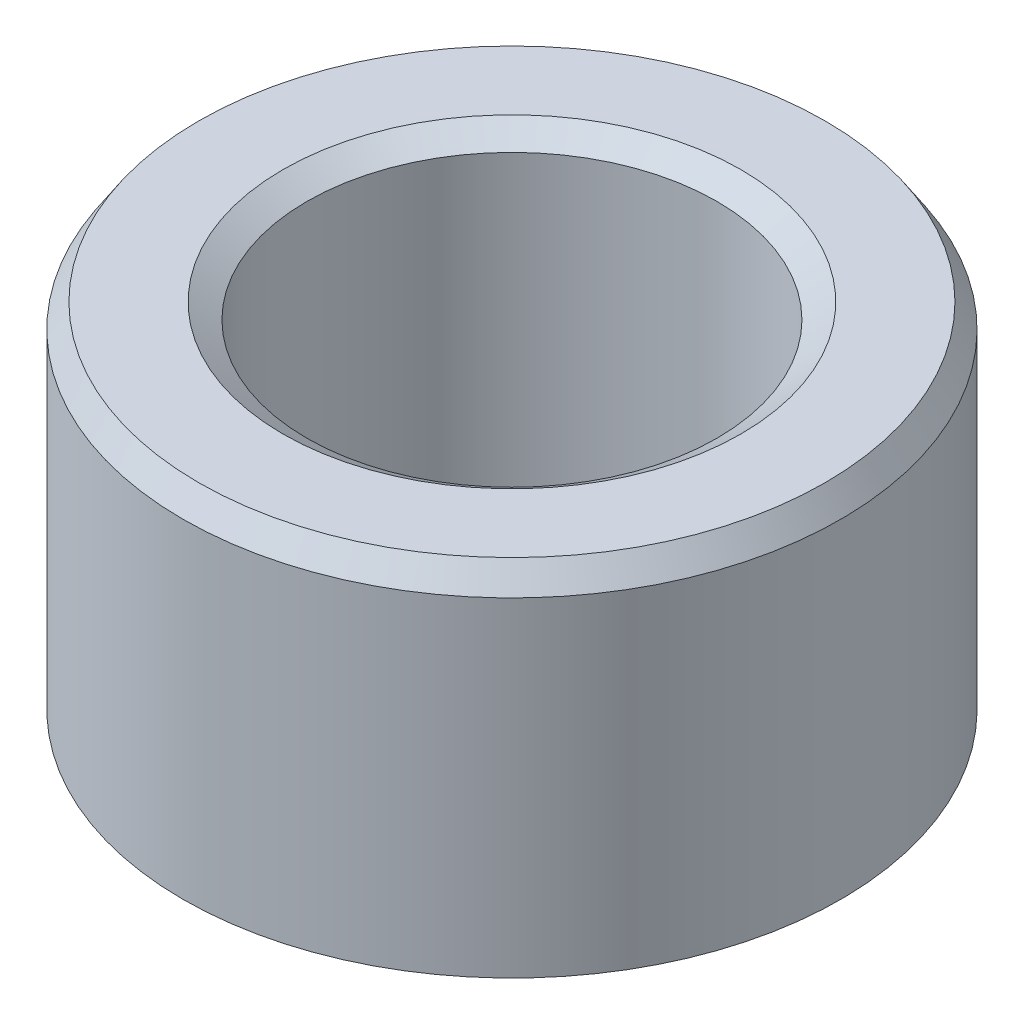
ISO-10303-21;
HEADER;
FILE_DESCRIPTION(('STEP AP214'),'2;1');
FILE_NAME('part.step','',(''),(''),'','','');
FILE_SCHEMA(('AUTOMOTIVE_DESIGN { 1 0 10303 214 1 1 1 1 }'));
ENDSEC;
DATA;
#1=APPLICATION_CONTEXT('core data for automotive mechanical design processes');
#2=APPLICATION_PROTOCOL_DEFINITION('international standard','automotive_design',2000,#1);
#3=PRODUCT_CONTEXT('',#1,'mechanical');
#4=PRODUCT('Part','Part','',(#3));
#5=PRODUCT_RELATED_PRODUCT_CATEGORY('part','',(#4));
#6=PRODUCT_DEFINITION_FORMATION('','',#4);
#7=PRODUCT_DEFINITION_CONTEXT('part definition',#1,'design');
#8=PRODUCT_DEFINITION('design','',#6,#7);
#9=PRODUCT_DEFINITION_SHAPE('','',#8);
#10=(LENGTH_UNIT() NAMED_UNIT(*) SI_UNIT(.MILLI.,.METRE.));
#11=(NAMED_UNIT(*) PLANE_ANGLE_UNIT() SI_UNIT($,.RADIAN.));
#12=(NAMED_UNIT(*) SI_UNIT($,.STERADIAN.) SOLID_ANGLE_UNIT());
#13=UNCERTAINTY_MEASURE_WITH_UNIT(LENGTH_MEASURE(1.E-05),#10,'distance_accuracy_value','');
#14=(GEOMETRIC_REPRESENTATION_CONTEXT(3) GLOBAL_UNCERTAINTY_ASSIGNED_CONTEXT((#13)) GLOBAL_UNIT_ASSIGNED_CONTEXT((#10,
#11,#12)) REPRESENTATION_CONTEXT('',''));
#15=CARTESIAN_POINT('',(0.,0.,0.));
#16=DIRECTION('',(0.,0.,1.));
#17=DIRECTION('',(1.,0.,0.));
#18=AXIS2_PLACEMENT_3D('',#15,#16,#17);
#19=CARTESIAN_POINT('',(0.,53.2531251113508,0.));
#20=DIRECTION('',(0.,-1.,0.));
#21=DIRECTION('',(0.,0.,-1.));
#22=AXIS2_PLACEMENT_3D('',#19,#20,#21);
#23=CYLINDRICAL_SURFACE('',#22,47.5);
#24=CARTESIAN_POINT('',(0.,2.25509263896022,0.));
#25=DIRECTION('',(0.,1.,0.));
#26=DIRECTION('',(0.,0.,1.));
#27=AXIS2_PLACEMENT_3D('',#24,#25,#26);
#28=CIRCLE('',#27,47.5);
#29=CARTESIAN_POINT('',(0.,2.25509263896022,47.5));
#30=VERTEX_POINT('',#29);
#31=EDGE_CURVE('E10',#30,#30,#28,.T.);
#32=ORIENTED_EDGE('',*,*,#31,.T.);
#33=EDGE_LOOP('',(#32));
#34=FACE_BOUND('',#33,.T.);
#35=CARTESIAN_POINT('',(0.,49.7995104509907,0.));
#36=DIRECTION('',(0.,1.,0.));
#37=DIRECTION('',(0.,0.,1.));
#38=AXIS2_PLACEMENT_3D('',#35,#36,#37);
#39=CIRCLE('',#38,47.5);
#40=CARTESIAN_POINT('',(0.,49.7995104509907,47.5));
#41=VERTEX_POINT('',#40);
#42=EDGE_CURVE('E50',#41,#41,#39,.F.);
#43=ORIENTED_EDGE('',*,*,#42,.T.);
#44=EDGE_LOOP('',(#43));
#45=FACE_BOUND('',#44,.T.);
#46=ADVANCED_FACE('F39',(#34,#45),#23,.T.);
#47=CARTESIAN_POINT('',(0.,53.2531251113508,0.));
#48=DIRECTION('',(0.,1.,0.));
#49=DIRECTION('',(0.,0.,1.));
#50=AXIS2_PLACEMENT_3D('',#47,#48,#49);
#51=PLANE('',#50);
#52=CARTESIAN_POINT('',(0.,53.2531251113508,0.));
#53=DIRECTION('',(0.,1.,0.));
#54=DIRECTION('',(0.,0.,1.));
#55=AXIS2_PLACEMENT_3D('',#52,#53,#54);
#56=CIRCLE('',#55,33.072922726898);
#57=CARTESIAN_POINT('',(0.,53.2531251113508,33.072922726898));
#58=VERTEX_POINT('',#57);
#59=EDGE_CURVE('E58',#58,#58,#56,.F.);
#60=ORIENTED_EDGE('',*,*,#59,.T.);
#61=EDGE_LOOP('',(#60));
#62=FACE_BOUND('',#61,.T.);
#63=CARTESIAN_POINT('',(0.,53.2531251113508,0.));
#64=DIRECTION('',(0.,1.,0.));
#65=DIRECTION('',(0.,0.,1.));
#66=AXIS2_PLACEMENT_3D('',#63,#64,#65);
#67=CIRCLE('',#66,45.2449073610398);
#68=CARTESIAN_POINT('',(0.,53.2531251113508,45.2449073610398));
#69=VERTEX_POINT('',#68);
#70=EDGE_CURVE('E61',#69,#69,#67,.T.);
#71=ORIENTED_EDGE('',*,*,#70,.T.);
#72=EDGE_LOOP('',(#71));
#73=FACE_BOUND('',#72,.T.);
#74=ADVANCED_FACE('F88',(#62,#73),#51,.T.);
#75=CARTESIAN_POINT('',(0.,0.,0.));
#76=DIRECTION('',(0.,1.,0.));
#77=DIRECTION('',(0.,0.,1.));
#78=AXIS2_PLACEMENT_3D('',#75,#76,#77);
#79=PLANE('',#78);
#80=CARTESIAN_POINT('',(0.,0.,0.));
#81=DIRECTION('',(0.,1.,0.));
#82=DIRECTION('',(0.,0.,1.));
#83=AXIS2_PLACEMENT_3D('',#80,#81,#82);
#84=CIRCLE('',#83,31.874400705498);
#85=CARTESIAN_POINT('',(0.,0.,31.874400705498));
#86=VERTEX_POINT('',#85);
#87=EDGE_CURVE('E51',#86,#86,#84,.T.);
#88=ORIENTED_EDGE('',*,*,#87,.T.);
#89=EDGE_LOOP('',(#88));
#90=FACE_BOUND('',#89,.T.);
#91=CARTESIAN_POINT('',(0.,0.,0.));
#92=DIRECTION('',(0.,1.,0.));
#93=DIRECTION('',(0.,0.,1.));
#94=AXIS2_PLACEMENT_3D('',#91,#92,#93);
#95=CIRCLE('',#94,44.0463853396399);
#96=CARTESIAN_POINT('',(0.,0.,44.0463853396399));
#97=VERTEX_POINT('',#96);
#98=EDGE_CURVE('E54',#97,#97,#95,.F.);
#99=ORIENTED_EDGE('',*,*,#98,.T.);
#100=EDGE_LOOP('',(#99));
#101=FACE_BOUND('',#100,.T.);
#102=ADVANCED_FACE('F83',(#90,#101),#79,.F.);
#103=CARTESIAN_POINT('',(0.,53.2531251113508,0.));
#104=DIRECTION('',(0.,-1.,0.));
#105=DIRECTION('',(0.,0.,-1.));
#106=AXIS2_PLACEMENT_3D('',#103,#104,#105);
#107=CYLINDRICAL_SURFACE('',#106,29.6193080665379);
#108=CARTESIAN_POINT('',(0.,50.9980324723906,0.));
#109=DIRECTION('',(0.,1.,0.));
#110=DIRECTION('',(0.,0.,1.));
#111=AXIS2_PLACEMENT_3D('',#108,#109,#110);
#112=CIRCLE('',#111,29.6193080665379);
#113=CARTESIAN_POINT('',(0.,50.9980324723906,29.6193080665379));
#114=VERTEX_POINT('',#113);
#115=EDGE_CURVE('E67',#114,#114,#112,.T.);
#116=ORIENTED_EDGE('',*,*,#115,.T.);
#117=EDGE_LOOP('',(#116));
#118=FACE_BOUND('',#117,.T.);
#119=CARTESIAN_POINT('',(0.,3.45361466036011,0.));
#120=DIRECTION('',(0.,1.,0.));
#121=DIRECTION('',(0.,0.,1.));
#122=AXIS2_PLACEMENT_3D('',#119,#120,#121);
#123=CIRCLE('',#122,29.6193080665379);
#124=CARTESIAN_POINT('',(0.,3.45361466036011,29.6193080665379));
#125=VERTEX_POINT('',#124);
#126=EDGE_CURVE('E69',#125,#125,#123,.F.);
#127=ORIENTED_EDGE('',*,*,#126,.T.);
#128=EDGE_LOOP('',(#127));
#129=FACE_BOUND('',#128,.T.);
#130=ADVANCED_FACE('F71',(#118,#129),#107,.F.);
#131=CARTESIAN_POINT('',(0.,50.9980324723906,0.));
#132=DIRECTION('',(0.,1.,0.));
#133=DIRECTION('',(0.,0.,1.));
#134=AXIS2_PLACEMENT_3D('',#131,#132,#133);
#135=CONICAL_SURFACE('',#134,29.6193080665379,0.992338932945223);
#136=ORIENTED_EDGE('',*,*,#59,.F.);
#137=EDGE_LOOP('',(#136));
#138=FACE_BOUND('',#137,.T.);
#139=ORIENTED_EDGE('',*,*,#115,.F.);
#140=EDGE_LOOP('',(#139));
#141=FACE_BOUND('',#140,.T.);
#142=ADVANCED_FACE('F77',(#138,#141),#135,.F.);
#143=CARTESIAN_POINT('',(0.,0.,0.));
#144=DIRECTION('',(0.,-1.,0.));
#145=DIRECTION('',(0.,0.,-1.));
#146=AXIS2_PLACEMENT_3D('',#143,#144,#145);
#147=CONICAL_SURFACE('',#146,31.874400705498,0.578457393849675);
#148=ORIENTED_EDGE('',*,*,#126,.F.);
#149=EDGE_LOOP('',(#148));
#150=FACE_BOUND('',#149,.T.);
#151=ORIENTED_EDGE('',*,*,#87,.F.);
#152=EDGE_LOOP('',(#151));
#153=FACE_BOUND('',#152,.T.);
#154=ADVANCED_FACE('F73',(#150,#153),#147,.F.);
#155=CARTESIAN_POINT('',(0.,2.25509263896022,0.));
#156=DIRECTION('',(0.,1.,0.));
#157=DIRECTION('',(0.,0.,1.));
#158=AXIS2_PLACEMENT_3D('',#155,#156,#157);
#159=CONICAL_SURFACE('',#158,47.5,0.992338932945223);
#160=ORIENTED_EDGE('',*,*,#98,.F.);
#161=EDGE_LOOP('',(#160));
#162=FACE_BOUND('',#161,.T.);
#163=ORIENTED_EDGE('',*,*,#31,.F.);
#164=EDGE_LOOP('',(#163));
#165=FACE_BOUND('',#164,.T.);
#166=ADVANCED_FACE('F76',(#162,#165),#159,.T.);
#167=CARTESIAN_POINT('',(0.,53.2531251113508,0.));
#168=DIRECTION('',(0.,-1.,0.));
#169=DIRECTION('',(0.,0.,-1.));
#170=AXIS2_PLACEMENT_3D('',#167,#168,#169);
#171=CONICAL_SURFACE('',#170,45.2449073610398,0.57845739384967);
#172=ORIENTED_EDGE('',*,*,#42,.F.);
#173=EDGE_LOOP('',(#172));
#174=FACE_BOUND('',#173,.T.);
#175=ORIENTED_EDGE('',*,*,#70,.F.);
#176=EDGE_LOOP('',(#175));
#177=FACE_BOUND('',#176,.T.);
#178=ADVANCED_FACE('F45',(#174,#177),#171,.T.);
#179=CLOSED_SHELL('',(#46,#74,#102,#130,#142,#154,#166,#178));
#180=MANIFOLD_SOLID_BREP('B2',#179);
#181=ADVANCED_BREP_SHAPE_REPRESENTATION('',(#18,#180),#14);
#182=SHAPE_DEFINITION_REPRESENTATION(#9,#181);
ENDSEC;
END-ISO-10303-21;
